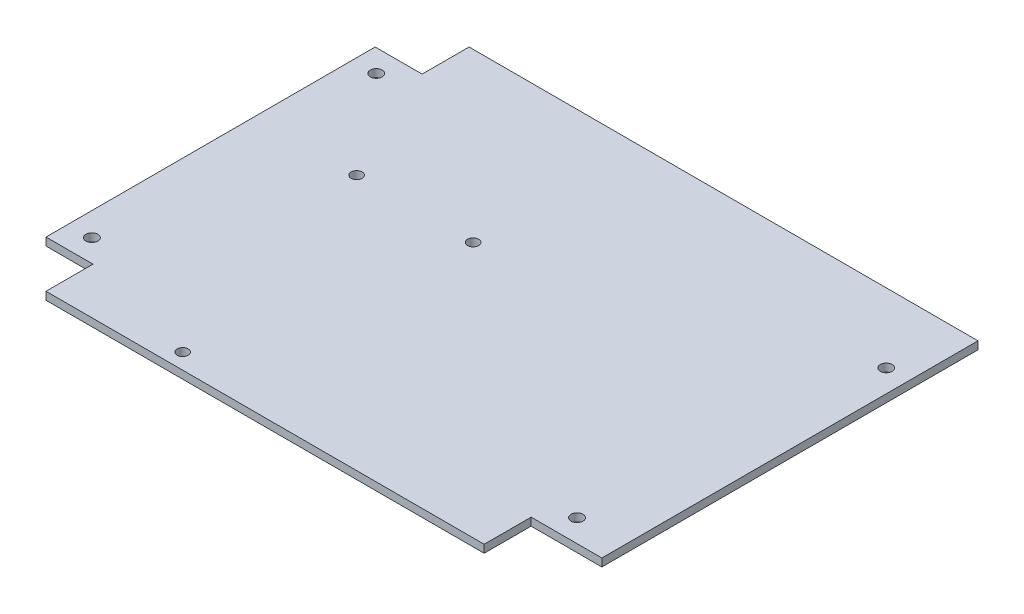
ISO-10303-21;
HEADER;
FILE_DESCRIPTION(('STEP AP214'),'2;1');
FILE_NAME('part.step','',(''),(''),'','','');
FILE_SCHEMA(('AUTOMOTIVE_DESIGN { 1 0 10303 214 1 1 1 1 }'));
ENDSEC;
DATA;
#1=APPLICATION_CONTEXT('core data for automotive mechanical design processes');
#2=APPLICATION_PROTOCOL_DEFINITION('international standard','automotive_design',2000,#1);
#3=PRODUCT_CONTEXT('',#1,'mechanical');
#4=PRODUCT('Part','Part','',(#3));
#5=PRODUCT_RELATED_PRODUCT_CATEGORY('part','',(#4));
#6=PRODUCT_DEFINITION_FORMATION('','',#4);
#7=PRODUCT_DEFINITION_CONTEXT('part definition',#1,'design');
#8=PRODUCT_DEFINITION('design','',#6,#7);
#9=PRODUCT_DEFINITION_SHAPE('','',#8);
#10=(LENGTH_UNIT() NAMED_UNIT(*) SI_UNIT(.MILLI.,.METRE.));
#11=(NAMED_UNIT(*) PLANE_ANGLE_UNIT() SI_UNIT($,.RADIAN.));
#12=(NAMED_UNIT(*) SI_UNIT($,.STERADIAN.) SOLID_ANGLE_UNIT());
#13=UNCERTAINTY_MEASURE_WITH_UNIT(LENGTH_MEASURE(1.E-05),#10,'distance_accuracy_value','');
#14=(GEOMETRIC_REPRESENTATION_CONTEXT(3) GLOBAL_UNCERTAINTY_ASSIGNED_CONTEXT((#13)) GLOBAL_UNIT_ASSIGNED_CONTEXT((#10,
#11,#12)) REPRESENTATION_CONTEXT('',''));
#15=CARTESIAN_POINT('',(0.,0.,0.));
#16=DIRECTION('',(0.,0.,1.));
#17=DIRECTION('',(1.,0.,0.));
#18=AXIS2_PLACEMENT_3D('',#15,#16,#17);
#19=CARTESIAN_POINT('',(-112.7633,3.175,85.8266));
#20=DIRECTION('',(1.,0.,0.));
#21=DIRECTION('',(0.,0.,-1.));
#22=AXIS2_PLACEMENT_3D('',#19,#20,#21);
#23=PLANE('',#22);
#24=DIRECTION('',(0.,0.,1.));
#25=VECTOR('',#24,1.);
#26=CARTESIAN_POINT('',(-112.7633,0.,85.8266));
#27=LINE('',#26,#25);
#28=CARTESIAN_POINT('',(-112.7633,0.,-66.7766));
#29=VERTEX_POINT('',#28);
#30=CARTESIAN_POINT('',(-112.7633,0.,66.7766));
#31=VERTEX_POINT('',#30);
#32=EDGE_CURVE('E130',#29,#31,#27,.T.);
#33=ORIENTED_EDGE('',*,*,#32,.T.);
#34=DIRECTION('',(0.,1.,0.));
#35=VECTOR('',#34,1.);
#36=CARTESIAN_POINT('',(-112.7633,0.,66.7766));
#37=LINE('',#36,#35);
#38=CARTESIAN_POINT('',(-112.7633,3.175,66.7766));
#39=VERTEX_POINT('',#38);
#40=EDGE_CURVE('E191',#31,#39,#37,.T.);
#41=ORIENTED_EDGE('',*,*,#40,.T.);
#42=DIRECTION('',(0.,0.,1.));
#43=VECTOR('',#42,1.);
#44=CARTESIAN_POINT('',(-112.7633,3.175,85.8266));
#45=LINE('',#44,#43);
#46=CARTESIAN_POINT('',(-112.7633,3.175,-66.7766));
#47=VERTEX_POINT('',#46);
#48=EDGE_CURVE('E139',#47,#39,#45,.T.);
#49=ORIENTED_EDGE('',*,*,#48,.F.);
#50=DIRECTION('',(0.,1.,0.));
#51=VECTOR('',#50,1.);
#52=CARTESIAN_POINT('',(-112.7633,0.,-66.7766));
#53=LINE('',#52,#51);
#54=EDGE_CURVE('E152',#29,#47,#53,.T.);
#55=ORIENTED_EDGE('',*,*,#54,.F.);
#56=EDGE_LOOP('',(#33,#41,#49,#55));
#57=FACE_BOUND('',#56,.T.);
#58=ADVANCED_FACE('F33',(#57),#23,.F.);
#59=CARTESIAN_POINT('',(112.7633,3.175,85.8266));
#60=DIRECTION('',(0.,0.,-1.));
#61=DIRECTION('',(-1.,0.,0.));
#62=AXIS2_PLACEMENT_3D('',#59,#60,#61);
#63=PLANE('',#62);
#64=DIRECTION('',(1.,0.,0.));
#65=VECTOR('',#64,1.);
#66=CARTESIAN_POINT('',(112.7633,3.175,85.8266));
#67=LINE('',#66,#65);
#68=CARTESIAN_POINT('',(-93.7133,3.175,85.8266));
#69=VERTEX_POINT('',#68);
#70=CARTESIAN_POINT('',(84.0613,3.175,85.8266));
#71=VERTEX_POINT('',#70);
#72=EDGE_CURVE('E125',#69,#71,#67,.T.);
#73=ORIENTED_EDGE('',*,*,#72,.F.);
#74=DIRECTION('',(0.,1.,0.));
#75=VECTOR('',#74,1.);
#76=CARTESIAN_POINT('',(-93.7133,0.,85.8266));
#77=LINE('',#76,#75);
#78=CARTESIAN_POINT('',(-93.7133,0.,85.8266));
#79=VERTEX_POINT('',#78);
#80=EDGE_CURVE('E113',#79,#69,#77,.T.);
#81=ORIENTED_EDGE('',*,*,#80,.F.);
#82=DIRECTION('',(1.,0.,0.));
#83=VECTOR('',#82,1.);
#84=CARTESIAN_POINT('',(112.7633,0.,85.8266));
#85=LINE('',#84,#83);
#86=CARTESIAN_POINT('',(84.0613,0.,85.8266));
#87=VERTEX_POINT('',#86);
#88=EDGE_CURVE('E124',#79,#87,#85,.T.);
#89=ORIENTED_EDGE('',*,*,#88,.T.);
#90=DIRECTION('',(0.,1.,0.));
#91=VECTOR('',#90,1.);
#92=CARTESIAN_POINT('',(84.0613,0.,85.8266));
#93=LINE('',#92,#91);
#94=EDGE_CURVE('E174',#87,#71,#93,.T.);
#95=ORIENTED_EDGE('',*,*,#94,.T.);
#96=EDGE_LOOP('',(#73,#81,#89,#95));
#97=FACE_BOUND('',#96,.T.);
#98=ADVANCED_FACE('F122',(#97),#63,.F.);
#99=CARTESIAN_POINT('',(112.7633,3.175,85.8266));
#100=DIRECTION('',(-1.,0.,0.));
#101=DIRECTION('',(0.,0.,1.));
#102=AXIS2_PLACEMENT_3D('',#99,#100,#101);
#103=PLANE('',#102);
#104=DIRECTION('',(0.,0.,-1.));
#105=VECTOR('',#104,1.);
#106=CARTESIAN_POINT('',(112.7633,3.175,85.8266));
#107=LINE('',#106,#105);
#108=CARTESIAN_POINT('',(112.7633,3.175,66.7766));
#109=VERTEX_POINT('',#108);
#110=CARTESIAN_POINT('',(112.7633,3.175,-85.8266));
#111=VERTEX_POINT('',#110);
#112=EDGE_CURVE('E149',#109,#111,#107,.T.);
#113=ORIENTED_EDGE('',*,*,#112,.F.);
#114=DIRECTION('',(0.,1.,0.));
#115=VECTOR('',#114,1.);
#116=CARTESIAN_POINT('',(112.7633,0.,66.7766));
#117=LINE('',#116,#115);
#118=CARTESIAN_POINT('',(112.7633,0.,66.7766));
#119=VERTEX_POINT('',#118);
#120=EDGE_CURVE('E179',#119,#109,#117,.T.);
#121=ORIENTED_EDGE('',*,*,#120,.F.);
#122=DIRECTION('',(0.,0.,-1.));
#123=VECTOR('',#122,1.);
#124=CARTESIAN_POINT('',(112.7633,0.,85.8266));
#125=LINE('',#124,#123);
#126=CARTESIAN_POINT('',(112.7633,0.,-85.8266));
#127=VERTEX_POINT('',#126);
#128=EDGE_CURVE('E129',#119,#127,#125,.T.);
#129=ORIENTED_EDGE('',*,*,#128,.T.);
#130=DIRECTION('',(0.,-1.,0.));
#131=VECTOR('',#130,1.);
#132=CARTESIAN_POINT('',(112.7633,3.175,-85.8266));
#133=LINE('',#132,#131);
#134=EDGE_CURVE('E11',#111,#127,#133,.T.);
#135=ORIENTED_EDGE('',*,*,#134,.F.);
#136=EDGE_LOOP('',(#113,#121,#129,#135));
#137=FACE_BOUND('',#136,.T.);
#138=ADVANCED_FACE('F282',(#137),#103,.F.);
#139=CARTESIAN_POINT('',(112.7633,3.175,-85.8266));
#140=DIRECTION('',(0.,0.,1.));
#141=DIRECTION('',(1.,0.,0.));
#142=AXIS2_PLACEMENT_3D('',#139,#140,#141);
#143=PLANE('',#142);
#144=DIRECTION('',(-1.,0.,0.));
#145=VECTOR('',#144,1.);
#146=CARTESIAN_POINT('',(112.7633,0.,-85.8266));
#147=LINE('',#146,#145);
#148=CARTESIAN_POINT('',(-93.7133,0.,-85.8266));
#149=VERTEX_POINT('',#148);
#150=EDGE_CURVE('E132',#127,#149,#147,.T.);
#151=ORIENTED_EDGE('',*,*,#150,.T.);
#152=DIRECTION('',(0.,1.,0.));
#153=VECTOR('',#152,1.);
#154=CARTESIAN_POINT('',(-93.7133,0.,-85.8266));
#155=LINE('',#154,#153);
#156=CARTESIAN_POINT('',(-93.7133,3.175,-85.8266));
#157=VERTEX_POINT('',#156);
#158=EDGE_CURVE('E135',#149,#157,#155,.T.);
#159=ORIENTED_EDGE('',*,*,#158,.T.);
#160=DIRECTION('',(-1.,0.,0.));
#161=VECTOR('',#160,1.);
#162=CARTESIAN_POINT('',(112.7633,3.175,-85.8266));
#163=LINE('',#162,#161);
#164=EDGE_CURVE('E40',#111,#157,#163,.T.);
#165=ORIENTED_EDGE('',*,*,#164,.F.);
#166=ORIENTED_EDGE('',*,*,#134,.T.);
#167=EDGE_LOOP('',(#151,#159,#165,#166));
#168=FACE_BOUND('',#167,.T.);
#169=ADVANCED_FACE('F163',(#168),#143,.F.);
#170=CARTESIAN_POINT('',(0.,3.175,0.));
#171=DIRECTION('',(0.,1.,0.));
#172=DIRECTION('',(0.,0.,1.));
#173=AXIS2_PLACEMENT_3D('',#170,#171,#172);
#174=PLANE('',#173);
#175=CARTESIAN_POINT('',(-44.6298483870968,3.175,79.4766));
#176=DIRECTION('',(0.,1.,0.));
#177=DIRECTION('',(0.,0.,1.));
#178=AXIS2_PLACEMENT_3D('',#175,#176,#177);
#179=CIRCLE('',#178,2.24789999999999);
#180=CARTESIAN_POINT('',(-44.6298483870968,3.175,81.7245));
#181=VERTEX_POINT('',#180);
#182=EDGE_CURVE('E240',#181,#181,#179,.T.);
#183=ORIENTED_EDGE('',*,*,#182,.F.);
#184=EDGE_LOOP('',(#183));
#185=FACE_BOUND('',#184,.T.);
#186=CARTESIAN_POINT('',(-24.2443,3.175,-17.9821915016256));
#187=DIRECTION('',(0.,1.,0.));
#188=DIRECTION('',(0.,0.,1.));
#189=AXIS2_PLACEMENT_3D('',#186,#187,#188);
#190=CIRCLE('',#189,2.24789999999999);
#191=CARTESIAN_POINT('',(-24.2443,3.175,-15.7342915016256));
#192=VERTEX_POINT('',#191);
#193=EDGE_CURVE('E234',#192,#192,#190,.T.);
#194=ORIENTED_EDGE('',*,*,#193,.F.);
#195=EDGE_LOOP('',(#194));
#196=FACE_BOUND('',#195,.T.);
#197=CARTESIAN_POINT('',(-71.4883,3.175,-17.9821915016256));
#198=DIRECTION('',(0.,1.,0.));
#199=DIRECTION('',(0.,0.,1.));
#200=AXIS2_PLACEMENT_3D('',#197,#198,#199);
#201=CIRCLE('',#200,2.24789999999998);
#202=CARTESIAN_POINT('',(-71.4883,3.175,-15.7342915016256));
#203=VERTEX_POINT('',#202);
#204=EDGE_CURVE('E228',#203,#203,#201,.T.);
#205=ORIENTED_EDGE('',*,*,#204,.F.);
#206=EDGE_LOOP('',(#205));
#207=FACE_BOUND('',#206,.T.);
#208=CARTESIAN_POINT('',(103.6701,3.175,-57.6834));
#209=DIRECTION('',(0.,1.,0.));
#210=DIRECTION('',(0.,0.,1.));
#211=AXIS2_PLACEMENT_3D('',#208,#209,#210);
#212=CIRCLE('',#211,2.4257);
#213=CARTESIAN_POINT('',(103.6701,3.175,-55.2577));
#214=VERTEX_POINT('',#213);
#215=EDGE_CURVE('E220',#214,#214,#212,.T.);
#216=ORIENTED_EDGE('',*,*,#215,.F.);
#217=EDGE_LOOP('',(#216));
#218=FACE_BOUND('',#217,.T.);
#219=CARTESIAN_POINT('',(93.5863,3.175,57.6834));
#220=DIRECTION('',(0.,1.,0.));
#221=DIRECTION('',(0.,0.,1.));
#222=AXIS2_PLACEMENT_3D('',#219,#220,#221);
#223=CIRCLE('',#222,2.4257);
#224=CARTESIAN_POINT('',(93.5863,3.175,60.1091));
#225=VERTEX_POINT('',#224);
#226=EDGE_CURVE('E214',#225,#225,#223,.T.);
#227=ORIENTED_EDGE('',*,*,#226,.F.);
#228=EDGE_LOOP('',(#227));
#229=FACE_BOUND('',#228,.T.);
#230=CARTESIAN_POINT('',(-103.2383,3.175,57.6834));
#231=DIRECTION('',(0.,1.,0.));
#232=DIRECTION('',(0.,0.,1.));
#233=AXIS2_PLACEMENT_3D('',#230,#231,#232);
#234=CIRCLE('',#233,2.4257);
#235=CARTESIAN_POINT('',(-103.2383,3.175,60.1091));
#236=VERTEX_POINT('',#235);
#237=EDGE_CURVE('E208',#236,#236,#234,.T.);
#238=ORIENTED_EDGE('',*,*,#237,.F.);
#239=EDGE_LOOP('',(#238));
#240=FACE_BOUND('',#239,.T.);
#241=CARTESIAN_POINT('',(-103.2383,3.175,-57.6834));
#242=DIRECTION('',(0.,1.,0.));
#243=DIRECTION('',(0.,0.,1.));
#244=AXIS2_PLACEMENT_3D('',#241,#242,#243);
#245=CIRCLE('',#244,2.4257);
#246=CARTESIAN_POINT('',(-103.2383,3.175,-55.2577));
#247=VERTEX_POINT('',#246);
#248=EDGE_CURVE('E202',#247,#247,#245,.T.);
#249=ORIENTED_EDGE('',*,*,#248,.F.);
#250=EDGE_LOOP('',(#249));
#251=FACE_BOUND('',#250,.T.);
#252=DIRECTION('',(-1.,0.,0.));
#253=VECTOR('',#252,1.);
#254=CARTESIAN_POINT('',(-112.7633,3.175,66.7766));
#255=LINE('',#254,#253);
#256=CARTESIAN_POINT('',(-93.7133,3.175,66.7766));
#257=VERTEX_POINT('',#256);
#258=EDGE_CURVE('E118',#257,#39,#255,.T.);
#259=ORIENTED_EDGE('',*,*,#258,.F.);
#260=DIRECTION('',(0.,0.,-1.));
#261=VECTOR('',#260,1.);
#262=CARTESIAN_POINT('',(-93.7133,3.175,85.8266));
#263=LINE('',#262,#261);
#264=EDGE_CURVE('E198',#69,#257,#263,.T.);
#265=ORIENTED_EDGE('',*,*,#264,.F.);
#266=ORIENTED_EDGE('',*,*,#72,.T.);
#267=DIRECTION('',(0.,0.,1.));
#268=VECTOR('',#267,1.);
#269=CARTESIAN_POINT('',(84.0613,3.175,85.8266));
#270=LINE('',#269,#268);
#271=CARTESIAN_POINT('',(84.0613,3.175,66.7766));
#272=VERTEX_POINT('',#271);
#273=EDGE_CURVE('E184',#272,#71,#270,.T.);
#274=ORIENTED_EDGE('',*,*,#273,.F.);
#275=DIRECTION('',(-1.,0.,0.));
#276=VECTOR('',#275,1.);
#277=CARTESIAN_POINT('',(112.7633,3.175,66.7766));
#278=LINE('',#277,#276);
#279=EDGE_CURVE('E188',#109,#272,#278,.T.);
#280=ORIENTED_EDGE('',*,*,#279,.F.);
#281=ORIENTED_EDGE('',*,*,#112,.T.);
#282=ORIENTED_EDGE('',*,*,#164,.T.);
#283=DIRECTION('',(0.,0.,-1.));
#284=VECTOR('',#283,1.);
#285=CARTESIAN_POINT('',(-93.7133,3.175,-85.8266));
#286=LINE('',#285,#284);
#287=CARTESIAN_POINT('',(-93.7133,3.175,-66.7766));
#288=VERTEX_POINT('',#287);
#289=EDGE_CURVE('E159',#288,#157,#286,.T.);
#290=ORIENTED_EDGE('',*,*,#289,.F.);
#291=DIRECTION('',(1.,0.,0.));
#292=VECTOR('',#291,1.);
#293=CARTESIAN_POINT('',(-112.7633,3.175,-66.7766));
#294=LINE('',#293,#292);
#295=EDGE_CURVE('E171',#47,#288,#294,.T.);
#296=ORIENTED_EDGE('',*,*,#295,.F.);
#297=ORIENTED_EDGE('',*,*,#48,.T.);
#298=EDGE_LOOP('',(#259,#265,#266,#274,#280,#281,#282,#290,#296,#297));
#299=FACE_BOUND('',#298,.T.);
#300=ADVANCED_FACE('F158',(#185,#196,#207,#218,#229,#240,#251,#299),#174,.T.);
#301=CARTESIAN_POINT('',(0.,0.,0.));
#302=DIRECTION('',(0.,1.,0.));
#303=DIRECTION('',(0.,0.,1.));
#304=AXIS2_PLACEMENT_3D('',#301,#302,#303);
#305=PLANE('',#304);
#306=CARTESIAN_POINT('',(-44.6298483870968,0.,79.4766));
#307=DIRECTION('',(0.,1.,0.));
#308=DIRECTION('',(0.,0.,1.));
#309=AXIS2_PLACEMENT_3D('',#306,#307,#308);
#310=CIRCLE('',#309,2.2479);
#311=CARTESIAN_POINT('',(-44.6298483870968,0.,81.7245));
#312=VERTEX_POINT('',#311);
#313=EDGE_CURVE('E237',#312,#312,#310,.T.);
#314=ORIENTED_EDGE('',*,*,#313,.T.);
#315=EDGE_LOOP('',(#314));
#316=FACE_BOUND('',#315,.T.);
#317=CARTESIAN_POINT('',(-24.2443,0.,-17.9821915016256));
#318=DIRECTION('',(0.,1.,0.));
#319=DIRECTION('',(0.,0.,1.));
#320=AXIS2_PLACEMENT_3D('',#317,#318,#319);
#321=CIRCLE('',#320,2.2479);
#322=CARTESIAN_POINT('',(-24.2443,0.,-15.7342915016256));
#323=VERTEX_POINT('',#322);
#324=EDGE_CURVE('E231',#323,#323,#321,.T.);
#325=ORIENTED_EDGE('',*,*,#324,.T.);
#326=EDGE_LOOP('',(#325));
#327=FACE_BOUND('',#326,.T.);
#328=CARTESIAN_POINT('',(-71.4883,0.,-17.9821915016256));
#329=DIRECTION('',(0.,1.,0.));
#330=DIRECTION('',(0.,0.,1.));
#331=AXIS2_PLACEMENT_3D('',#328,#329,#330);
#332=CIRCLE('',#331,2.2479);
#333=CARTESIAN_POINT('',(-71.4883,0.,-15.7342915016256));
#334=VERTEX_POINT('',#333);
#335=EDGE_CURVE('E223',#334,#334,#332,.T.);
#336=ORIENTED_EDGE('',*,*,#335,.T.);
#337=EDGE_LOOP('',(#336));
#338=FACE_BOUND('',#337,.T.);
#339=CARTESIAN_POINT('',(103.6701,0.,-57.6834));
#340=DIRECTION('',(0.,1.,0.));
#341=DIRECTION('',(0.,0.,1.));
#342=AXIS2_PLACEMENT_3D('',#339,#340,#341);
#343=CIRCLE('',#342,2.4257);
#344=CARTESIAN_POINT('',(103.6701,0.,-55.2577));
#345=VERTEX_POINT('',#344);
#346=EDGE_CURVE('E217',#345,#345,#343,.T.);
#347=ORIENTED_EDGE('',*,*,#346,.T.);
#348=EDGE_LOOP('',(#347));
#349=FACE_BOUND('',#348,.T.);
#350=CARTESIAN_POINT('',(93.5863,0.,57.6834));
#351=DIRECTION('',(0.,1.,0.));
#352=DIRECTION('',(0.,0.,1.));
#353=AXIS2_PLACEMENT_3D('',#350,#351,#352);
#354=CIRCLE('',#353,2.4257);
#355=CARTESIAN_POINT('',(93.5863,0.,60.1091));
#356=VERTEX_POINT('',#355);
#357=EDGE_CURVE('E211',#356,#356,#354,.T.);
#358=ORIENTED_EDGE('',*,*,#357,.T.);
#359=EDGE_LOOP('',(#358));
#360=FACE_BOUND('',#359,.T.);
#361=CARTESIAN_POINT('',(-103.2383,0.,57.6834));
#362=DIRECTION('',(0.,1.,0.));
#363=DIRECTION('',(0.,0.,1.));
#364=AXIS2_PLACEMENT_3D('',#361,#362,#363);
#365=CIRCLE('',#364,2.4257);
#366=CARTESIAN_POINT('',(-103.2383,0.,60.1091));
#367=VERTEX_POINT('',#366);
#368=EDGE_CURVE('E205',#367,#367,#365,.T.);
#369=ORIENTED_EDGE('',*,*,#368,.T.);
#370=EDGE_LOOP('',(#369));
#371=FACE_BOUND('',#370,.T.);
#372=CARTESIAN_POINT('',(-103.2383,0.,-57.6834));
#373=DIRECTION('',(0.,1.,0.));
#374=DIRECTION('',(0.,0.,1.));
#375=AXIS2_PLACEMENT_3D('',#372,#373,#374);
#376=CIRCLE('',#375,2.4257);
#377=CARTESIAN_POINT('',(-103.2383,0.,-55.2577));
#378=VERTEX_POINT('',#377);
#379=EDGE_CURVE('E200',#378,#378,#376,.T.);
#380=ORIENTED_EDGE('',*,*,#379,.T.);
#381=EDGE_LOOP('',(#380));
#382=FACE_BOUND('',#381,.T.);
#383=DIRECTION('',(0.,0.,-1.));
#384=VECTOR('',#383,1.);
#385=CARTESIAN_POINT('',(-93.7133,0.,85.8266));
#386=LINE('',#385,#384);
#387=CARTESIAN_POINT('',(-93.7133,0.,66.7766));
#388=VERTEX_POINT('',#387);
#389=EDGE_CURVE('E109',#79,#388,#386,.T.);
#390=ORIENTED_EDGE('',*,*,#389,.T.);
#391=DIRECTION('',(-1.,0.,0.));
#392=VECTOR('',#391,1.);
#393=CARTESIAN_POINT('',(-112.7633,0.,66.7766));
#394=LINE('',#393,#392);
#395=EDGE_CURVE('E47',#388,#31,#394,.T.);
#396=ORIENTED_EDGE('',*,*,#395,.T.);
#397=ORIENTED_EDGE('',*,*,#32,.F.);
#398=DIRECTION('',(1.,0.,0.));
#399=VECTOR('',#398,1.);
#400=CARTESIAN_POINT('',(-112.7633,0.,-66.7766));
#401=LINE('',#400,#399);
#402=CARTESIAN_POINT('',(-93.7133,0.,-66.7766));
#403=VERTEX_POINT('',#402);
#404=EDGE_CURVE('E170',#29,#403,#401,.T.);
#405=ORIENTED_EDGE('',*,*,#404,.T.);
#406=DIRECTION('',(0.,0.,-1.));
#407=VECTOR('',#406,1.);
#408=CARTESIAN_POINT('',(-93.7133,0.,-85.8266));
#409=LINE('',#408,#407);
#410=EDGE_CURVE('E175',#403,#149,#409,.T.);
#411=ORIENTED_EDGE('',*,*,#410,.T.);
#412=ORIENTED_EDGE('',*,*,#150,.F.);
#413=ORIENTED_EDGE('',*,*,#128,.F.);
#414=DIRECTION('',(-1.,0.,0.));
#415=VECTOR('',#414,1.);
#416=CARTESIAN_POINT('',(112.7633,0.,66.7766));
#417=LINE('',#416,#415);
#418=CARTESIAN_POINT('',(84.0613,0.,66.7766));
#419=VERTEX_POINT('',#418);
#420=EDGE_CURVE('E187',#119,#419,#417,.T.);
#421=ORIENTED_EDGE('',*,*,#420,.T.);
#422=DIRECTION('',(0.,0.,1.));
#423=VECTOR('',#422,1.);
#424=CARTESIAN_POINT('',(84.0613,0.,85.8266));
#425=LINE('',#424,#423);
#426=EDGE_CURVE('E55',#419,#87,#425,.T.);
#427=ORIENTED_EDGE('',*,*,#426,.T.);
#428=ORIENTED_EDGE('',*,*,#88,.F.);
#429=EDGE_LOOP('',(#390,#396,#397,#405,#411,#412,#413,#421,#427,#428));
#430=FACE_BOUND('',#429,.T.);
#431=ADVANCED_FACE('F127',(#316,#327,#338,#349,#360,#371,#382,#430),#305,.F.);
#432=CARTESIAN_POINT('',(-93.7133,0.,-85.8266));
#433=DIRECTION('',(1.,0.,0.));
#434=DIRECTION('',(0.,0.,-1.));
#435=AXIS2_PLACEMENT_3D('',#432,#433,#434);
#436=PLANE('',#435);
#437=ORIENTED_EDGE('',*,*,#289,.T.);
#438=ORIENTED_EDGE('',*,*,#158,.F.);
#439=ORIENTED_EDGE('',*,*,#410,.F.);
#440=DIRECTION('',(0.,1.,0.));
#441=VECTOR('',#440,1.);
#442=CARTESIAN_POINT('',(-93.7133,0.,-66.7766));
#443=LINE('',#442,#441);
#444=EDGE_CURVE('E166',#403,#288,#443,.T.);
#445=ORIENTED_EDGE('',*,*,#444,.T.);
#446=EDGE_LOOP('',(#437,#438,#439,#445));
#447=FACE_BOUND('',#446,.T.);
#448=ADVANCED_FACE('F288',(#447),#436,.F.);
#449=CARTESIAN_POINT('',(-112.7633,0.,-66.7766));
#450=DIRECTION('',(0.,0.,1.));
#451=DIRECTION('',(1.,0.,0.));
#452=AXIS2_PLACEMENT_3D('',#449,#450,#451);
#453=PLANE('',#452);
#454=ORIENTED_EDGE('',*,*,#295,.T.);
#455=ORIENTED_EDGE('',*,*,#444,.F.);
#456=ORIENTED_EDGE('',*,*,#404,.F.);
#457=ORIENTED_EDGE('',*,*,#54,.T.);
#458=EDGE_LOOP('',(#454,#455,#456,#457));
#459=FACE_BOUND('',#458,.T.);
#460=ADVANCED_FACE('F287',(#459),#453,.F.);
#461=CARTESIAN_POINT('',(84.0613,0.,85.8266));
#462=DIRECTION('',(-1.,0.,0.));
#463=DIRECTION('',(0.,0.,1.));
#464=AXIS2_PLACEMENT_3D('',#461,#462,#463);
#465=PLANE('',#464);
#466=ORIENTED_EDGE('',*,*,#273,.T.);
#467=ORIENTED_EDGE('',*,*,#94,.F.);
#468=ORIENTED_EDGE('',*,*,#426,.F.);
#469=DIRECTION('',(0.,1.,0.));
#470=VECTOR('',#469,1.);
#471=CARTESIAN_POINT('',(84.0613,0.,66.7766));
#472=LINE('',#471,#470);
#473=EDGE_CURVE('E181',#419,#272,#472,.T.);
#474=ORIENTED_EDGE('',*,*,#473,.T.);
#475=EDGE_LOOP('',(#466,#467,#468,#474));
#476=FACE_BOUND('',#475,.T.);
#477=ADVANCED_FACE('F295',(#476),#465,.F.);
#478=CARTESIAN_POINT('',(112.7633,0.,66.7766));
#479=DIRECTION('',(0.,0.,-1.));
#480=DIRECTION('',(-1.,0.,0.));
#481=AXIS2_PLACEMENT_3D('',#478,#479,#480);
#482=PLANE('',#481);
#483=ORIENTED_EDGE('',*,*,#279,.T.);
#484=ORIENTED_EDGE('',*,*,#473,.F.);
#485=ORIENTED_EDGE('',*,*,#420,.F.);
#486=ORIENTED_EDGE('',*,*,#120,.T.);
#487=EDGE_LOOP('',(#483,#484,#485,#486));
#488=FACE_BOUND('',#487,.T.);
#489=ADVANCED_FACE('F300',(#488),#482,.F.);
#490=CARTESIAN_POINT('',(-112.7633,0.,66.7766));
#491=DIRECTION('',(0.,0.,-1.));
#492=DIRECTION('',(-1.,0.,0.));
#493=AXIS2_PLACEMENT_3D('',#490,#491,#492);
#494=PLANE('',#493);
#495=ORIENTED_EDGE('',*,*,#258,.T.);
#496=ORIENTED_EDGE('',*,*,#40,.F.);
#497=ORIENTED_EDGE('',*,*,#395,.F.);
#498=DIRECTION('',(0.,1.,0.));
#499=VECTOR('',#498,1.);
#500=CARTESIAN_POINT('',(-93.7133,0.,66.7766));
#501=LINE('',#500,#499);
#502=EDGE_CURVE('E115',#388,#257,#501,.T.);
#503=ORIENTED_EDGE('',*,*,#502,.T.);
#504=EDGE_LOOP('',(#495,#496,#497,#503));
#505=FACE_BOUND('',#504,.T.);
#506=ADVANCED_FACE('F273',(#505),#494,.F.);
#507=CARTESIAN_POINT('',(-93.7133,0.,85.8266));
#508=DIRECTION('',(1.,0.,0.));
#509=DIRECTION('',(0.,0.,-1.));
#510=AXIS2_PLACEMENT_3D('',#507,#508,#509);
#511=PLANE('',#510);
#512=ORIENTED_EDGE('',*,*,#264,.T.);
#513=ORIENTED_EDGE('',*,*,#502,.F.);
#514=ORIENTED_EDGE('',*,*,#389,.F.);
#515=ORIENTED_EDGE('',*,*,#80,.T.);
#516=EDGE_LOOP('',(#512,#513,#514,#515));
#517=FACE_BOUND('',#516,.T.);
#518=ADVANCED_FACE('F112',(#517),#511,.F.);
#519=CARTESIAN_POINT('',(-103.2383,0.,-57.6834));
#520=DIRECTION('',(0.,1.,0.));
#521=DIRECTION('',(0.,0.,1.));
#522=AXIS2_PLACEMENT_3D('',#519,#520,#521);
#523=CYLINDRICAL_SURFACE('',#522,2.4257);
#524=ORIENTED_EDGE('',*,*,#379,.F.);
#525=EDGE_LOOP('',(#524));
#526=FACE_BOUND('',#525,.T.);
#527=ORIENTED_EDGE('',*,*,#248,.T.);
#528=EDGE_LOOP('',(#527));
#529=FACE_BOUND('',#528,.T.);
#530=ADVANCED_FACE('F261',(#526,#529),#523,.F.);
#531=CARTESIAN_POINT('',(-103.2383,0.,57.6834));
#532=DIRECTION('',(0.,1.,0.));
#533=DIRECTION('',(0.,0.,1.));
#534=AXIS2_PLACEMENT_3D('',#531,#532,#533);
#535=CYLINDRICAL_SURFACE('',#534,2.4257);
#536=ORIENTED_EDGE('',*,*,#368,.F.);
#537=EDGE_LOOP('',(#536));
#538=FACE_BOUND('',#537,.T.);
#539=ORIENTED_EDGE('',*,*,#237,.T.);
#540=EDGE_LOOP('',(#539));
#541=FACE_BOUND('',#540,.T.);
#542=ADVANCED_FACE('F263',(#538,#541),#535,.F.);
#543=CARTESIAN_POINT('',(93.5863,0.,57.6834));
#544=DIRECTION('',(0.,1.,0.));
#545=DIRECTION('',(0.,0.,1.));
#546=AXIS2_PLACEMENT_3D('',#543,#544,#545);
#547=CYLINDRICAL_SURFACE('',#546,2.4257);
#548=ORIENTED_EDGE('',*,*,#357,.F.);
#549=EDGE_LOOP('',(#548));
#550=FACE_BOUND('',#549,.T.);
#551=ORIENTED_EDGE('',*,*,#226,.T.);
#552=EDGE_LOOP('',(#551));
#553=FACE_BOUND('',#552,.T.);
#554=ADVANCED_FACE('F270',(#550,#553),#547,.F.);
#555=CARTESIAN_POINT('',(103.6701,0.,-57.6834));
#556=DIRECTION('',(0.,1.,0.));
#557=DIRECTION('',(0.,0.,1.));
#558=AXIS2_PLACEMENT_3D('',#555,#556,#557);
#559=CYLINDRICAL_SURFACE('',#558,2.4257);
#560=ORIENTED_EDGE('',*,*,#346,.F.);
#561=EDGE_LOOP('',(#560));
#562=FACE_BOUND('',#561,.T.);
#563=ORIENTED_EDGE('',*,*,#215,.T.);
#564=EDGE_LOOP('',(#563));
#565=FACE_BOUND('',#564,.T.);
#566=ADVANCED_FACE('F355',(#562,#565),#559,.F.);
#567=CARTESIAN_POINT('',(-71.4883,3.175,-17.9821915016256));
#568=DIRECTION('',(0.,1.,0.));
#569=DIRECTION('',(0.,0.,1.));
#570=AXIS2_PLACEMENT_3D('',#567,#568,#569);
#571=CYLINDRICAL_SURFACE('',#570,2.24789999999999);
#572=ORIENTED_EDGE('',*,*,#335,.F.);
#573=EDGE_LOOP('',(#572));
#574=FACE_BOUND('',#573,.T.);
#575=ORIENTED_EDGE('',*,*,#204,.T.);
#576=EDGE_LOOP('',(#575));
#577=FACE_BOUND('',#576,.T.);
#578=ADVANCED_FACE('F365',(#574,#577),#571,.F.);
#579=CARTESIAN_POINT('',(-24.2443,3.175,-17.9821915016256));
#580=DIRECTION('',(0.,1.,0.));
#581=DIRECTION('',(0.,0.,1.));
#582=AXIS2_PLACEMENT_3D('',#579,#580,#581);
#583=CYLINDRICAL_SURFACE('',#582,2.24789999999999);
#584=ORIENTED_EDGE('',*,*,#324,.F.);
#585=EDGE_LOOP('',(#584));
#586=FACE_BOUND('',#585,.T.);
#587=ORIENTED_EDGE('',*,*,#193,.T.);
#588=EDGE_LOOP('',(#587));
#589=FACE_BOUND('',#588,.T.);
#590=ADVANCED_FACE('F389',(#586,#589),#583,.F.);
#591=CARTESIAN_POINT('',(-44.6298483870968,3.175,79.4766));
#592=DIRECTION('',(0.,1.,0.));
#593=DIRECTION('',(0.,0.,1.));
#594=AXIS2_PLACEMENT_3D('',#591,#592,#593);
#595=CYLINDRICAL_SURFACE('',#594,2.24789999999999);
#596=ORIENTED_EDGE('',*,*,#313,.F.);
#597=EDGE_LOOP('',(#596));
#598=FACE_BOUND('',#597,.T.);
#599=ORIENTED_EDGE('',*,*,#182,.T.);
#600=EDGE_LOOP('',(#599));
#601=FACE_BOUND('',#600,.T.);
#602=ADVANCED_FACE('F244',(#598,#601),#595,.F.);
#603=CLOSED_SHELL('',(#58,#98,#138,#169,#300,#431,#448,#460,#477,#489,#506,#518,#530,#542,#554,
#566,#578,#590,#602));
#604=MANIFOLD_SOLID_BREP('B2',#603);
#605=ADVANCED_BREP_SHAPE_REPRESENTATION('',(#18,#604),#14);
#606=SHAPE_DEFINITION_REPRESENTATION(#9,#605);
ENDSEC;
END-ISO-10303-21;
